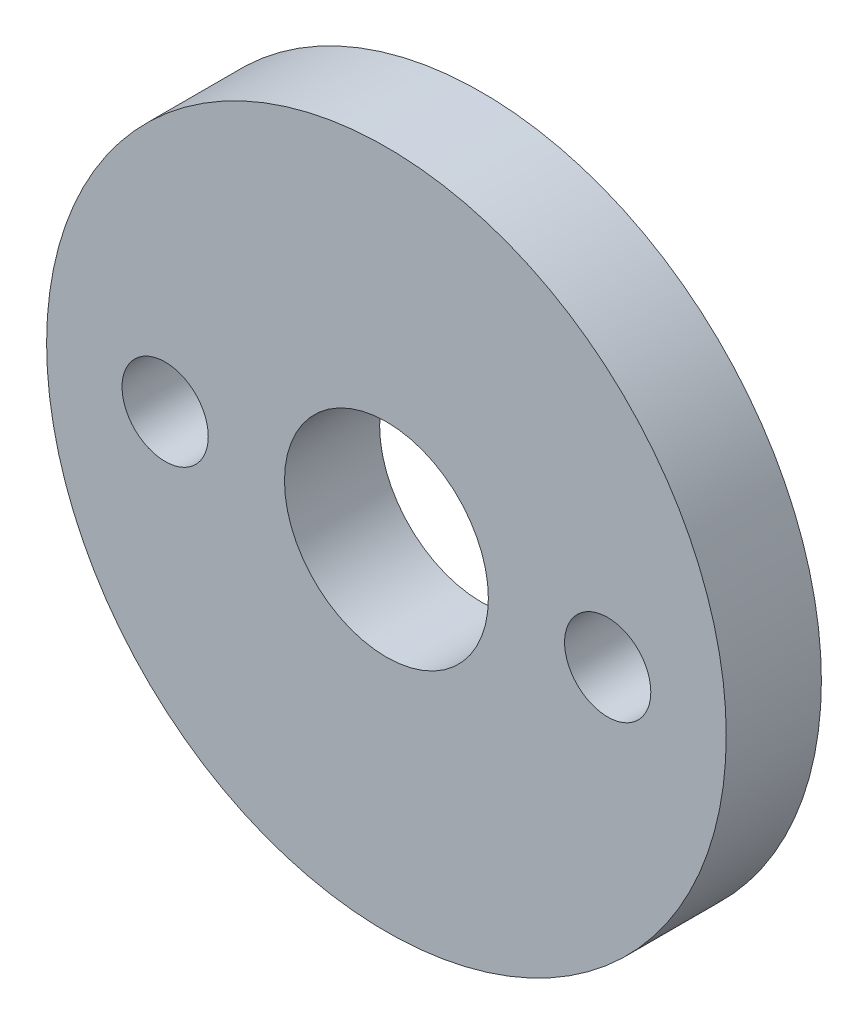
ISO-10303-21;
HEADER;
FILE_DESCRIPTION(('STEP AP214'),'2;1');
FILE_NAME('part.step','',(''),(''),'','','');
FILE_SCHEMA(('AUTOMOTIVE_DESIGN { 1 0 10303 214 1 1 1 1 }'));
ENDSEC;
DATA;
#1=APPLICATION_CONTEXT('core data for automotive mechanical design processes');
#2=APPLICATION_PROTOCOL_DEFINITION('international standard','automotive_design',2000,#1);
#3=PRODUCT_CONTEXT('',#1,'mechanical');
#4=PRODUCT('Part','Part','',(#3));
#5=PRODUCT_RELATED_PRODUCT_CATEGORY('part','',(#4));
#6=PRODUCT_DEFINITION_FORMATION('','',#4);
#7=PRODUCT_DEFINITION_CONTEXT('part definition',#1,'design');
#8=PRODUCT_DEFINITION('design','',#6,#7);
#9=PRODUCT_DEFINITION_SHAPE('','',#8);
#10=(LENGTH_UNIT() NAMED_UNIT(*) SI_UNIT(.MILLI.,.METRE.));
#11=(NAMED_UNIT(*) PLANE_ANGLE_UNIT() SI_UNIT($,.RADIAN.));
#12=(NAMED_UNIT(*) SI_UNIT($,.STERADIAN.) SOLID_ANGLE_UNIT());
#13=UNCERTAINTY_MEASURE_WITH_UNIT(LENGTH_MEASURE(1.E-05),#10,'distance_accuracy_value','');
#14=(GEOMETRIC_REPRESENTATION_CONTEXT(3) GLOBAL_UNCERTAINTY_ASSIGNED_CONTEXT((#13)) GLOBAL_UNIT_ASSIGNED_CONTEXT((#10,
#11,#12)) REPRESENTATION_CONTEXT('',''));
#15=CARTESIAN_POINT('',(0.,0.,0.));
#16=DIRECTION('',(0.,0.,1.));
#17=DIRECTION('',(1.,0.,0.));
#18=AXIS2_PLACEMENT_3D('',#15,#16,#17);
#19=CARTESIAN_POINT('',(0.,0.,3.2004));
#20=DIRECTION('',(0.,0.,1.));
#21=DIRECTION('',(1.,0.,0.));
#22=AXIS2_PLACEMENT_3D('',#19,#20,#21);
#23=PLANE('',#22);
#24=CARTESIAN_POINT('',(-7.4422000541545,0.,3.2004));
#25=DIRECTION('',(0.,0.,1.));
#26=DIRECTION('',(1.,0.,0.));
#27=AXIS2_PLACEMENT_3D('',#24,#25,#26);
#28=CIRCLE('',#27,1.45);
#29=CARTESIAN_POINT('',(-5.9922000541545,0.,3.2004));
#30=VERTEX_POINT('',#29);
#31=EDGE_CURVE('E53',#30,#30,#28,.T.);
#32=ORIENTED_EDGE('',*,*,#31,.F.);
#33=EDGE_LOOP('',(#32));
#34=FACE_BOUND('',#33,.T.);
#35=CARTESIAN_POINT('',(7.4422000541545,0.,3.2004));
#36=DIRECTION('',(0.,0.,1.));
#37=DIRECTION('',(1.,0.,0.));
#38=AXIS2_PLACEMENT_3D('',#35,#36,#37);
#39=CIRCLE('',#38,1.45);
#40=CARTESIAN_POINT('',(8.8922000541545,0.,3.2004));
#41=VERTEX_POINT('',#40);
#42=EDGE_CURVE('E54',#41,#41,#39,.T.);
#43=ORIENTED_EDGE('',*,*,#42,.F.);
#44=EDGE_LOOP('',(#43));
#45=FACE_BOUND('',#44,.T.);
#46=CARTESIAN_POINT('',(0.,0.,3.2004));
#47=DIRECTION('',(0.,0.,1.));
#48=DIRECTION('',(1.,0.,0.));
#49=AXIS2_PLACEMENT_3D('',#46,#47,#48);
#50=CIRCLE('',#49,11.43);
#51=CARTESIAN_POINT('',(11.43,0.,3.2004));
#52=VERTEX_POINT('',#51);
#53=EDGE_CURVE('E10',#52,#52,#50,.T.);
#54=ORIENTED_EDGE('',*,*,#53,.T.);
#55=EDGE_LOOP('',(#54));
#56=FACE_BOUND('',#55,.T.);
#57=CARTESIAN_POINT('',(0.,0.,3.2004));
#58=DIRECTION('',(0.,0.,1.));
#59=DIRECTION('',(1.,0.,0.));
#60=AXIS2_PLACEMENT_3D('',#57,#58,#59);
#61=CIRCLE('',#60,3.429);
#62=CARTESIAN_POINT('',(3.429,0.,3.2004));
#63=VERTEX_POINT('',#62);
#64=EDGE_CURVE('E42',#63,#63,#61,.T.);
#65=ORIENTED_EDGE('',*,*,#64,.F.);
#66=EDGE_LOOP('',(#65));
#67=FACE_BOUND('',#66,.T.);
#68=ADVANCED_FACE('F31',(#34,#45,#56,#67),#23,.T.);
#69=CARTESIAN_POINT('',(0.,0.,0.));
#70=DIRECTION('',(0.,0.,1.));
#71=DIRECTION('',(1.,0.,0.));
#72=AXIS2_PLACEMENT_3D('',#69,#70,#71);
#73=PLANE('',#72);
#74=CARTESIAN_POINT('',(-7.4422000541545,0.,0.));
#75=DIRECTION('',(0.,0.,1.));
#76=DIRECTION('',(1.,0.,0.));
#77=AXIS2_PLACEMENT_3D('',#74,#75,#76);
#78=CIRCLE('',#77,1.45);
#79=CARTESIAN_POINT('',(-5.9922000541545,0.,0.));
#80=VERTEX_POINT('',#79);
#81=EDGE_CURVE('E47',#80,#80,#78,.F.);
#82=ORIENTED_EDGE('',*,*,#81,.F.);
#83=EDGE_LOOP('',(#82));
#84=FACE_BOUND('',#83,.T.);
#85=CARTESIAN_POINT('',(7.4422000541545,0.,0.));
#86=DIRECTION('',(0.,0.,1.));
#87=DIRECTION('',(1.,0.,0.));
#88=AXIS2_PLACEMENT_3D('',#85,#86,#87);
#89=CIRCLE('',#88,1.45);
#90=CARTESIAN_POINT('',(8.8922000541545,0.,0.));
#91=VERTEX_POINT('',#90);
#92=EDGE_CURVE('E50',#91,#91,#89,.F.);
#93=ORIENTED_EDGE('',*,*,#92,.F.);
#94=EDGE_LOOP('',(#93));
#95=FACE_BOUND('',#94,.T.);
#96=CARTESIAN_POINT('',(0.,0.,0.));
#97=DIRECTION('',(0.,0.,1.));
#98=DIRECTION('',(1.,0.,0.));
#99=AXIS2_PLACEMENT_3D('',#96,#97,#98);
#100=CIRCLE('',#99,11.43);
#101=CARTESIAN_POINT('',(11.43,0.,0.));
#102=VERTEX_POINT('',#101);
#103=EDGE_CURVE('E35',#102,#102,#100,.T.);
#104=ORIENTED_EDGE('',*,*,#103,.F.);
#105=EDGE_LOOP('',(#104));
#106=FACE_BOUND('',#105,.T.);
#107=CARTESIAN_POINT('',(0.,0.,0.));
#108=DIRECTION('',(0.,0.,1.));
#109=DIRECTION('',(1.,0.,0.));
#110=AXIS2_PLACEMENT_3D('',#107,#108,#109);
#111=CIRCLE('',#110,3.429);
#112=CARTESIAN_POINT('',(3.429,0.,0.));
#113=VERTEX_POINT('',#112);
#114=EDGE_CURVE('E44',#113,#113,#111,.T.);
#115=ORIENTED_EDGE('',*,*,#114,.T.);
#116=EDGE_LOOP('',(#115));
#117=FACE_BOUND('',#116,.T.);
#118=ADVANCED_FACE('F66',(#84,#95,#106,#117),#73,.F.);
#119=CARTESIAN_POINT('',(0.,0.,3.2004));
#120=DIRECTION('',(0.,0.,-1.));
#121=DIRECTION('',(-1.,0.,0.));
#122=AXIS2_PLACEMENT_3D('',#119,#120,#121);
#123=CYLINDRICAL_SURFACE('',#122,11.43);
#124=ORIENTED_EDGE('',*,*,#53,.F.);
#125=EDGE_LOOP('',(#124));
#126=FACE_BOUND('',#125,.T.);
#127=ORIENTED_EDGE('',*,*,#103,.T.);
#128=EDGE_LOOP('',(#127));
#129=FACE_BOUND('',#128,.T.);
#130=ADVANCED_FACE('F33',(#126,#129),#123,.T.);
#131=CARTESIAN_POINT('',(0.,0.,3.2004));
#132=DIRECTION('',(0.,0.,-1.));
#133=DIRECTION('',(-1.,0.,0.));
#134=AXIS2_PLACEMENT_3D('',#131,#132,#133);
#135=CYLINDRICAL_SURFACE('',#134,3.429);
#136=ORIENTED_EDGE('',*,*,#64,.T.);
#137=EDGE_LOOP('',(#136));
#138=FACE_BOUND('',#137,.T.);
#139=ORIENTED_EDGE('',*,*,#114,.F.);
#140=EDGE_LOOP('',(#139));
#141=FACE_BOUND('',#140,.T.);
#142=ADVANCED_FACE('F72',(#138,#141),#135,.F.);
#143=CARTESIAN_POINT('',(7.4422000541545,0.,-4.10121933088198));
#144=DIRECTION('',(0.,0.,1.));
#145=DIRECTION('',(1.,0.,0.));
#146=AXIS2_PLACEMENT_3D('',#143,#144,#145);
#147=CYLINDRICAL_SURFACE('',#146,1.45);
#148=ORIENTED_EDGE('',*,*,#92,.T.);
#149=EDGE_LOOP('',(#148));
#150=FACE_BOUND('',#149,.T.);
#151=ORIENTED_EDGE('',*,*,#42,.T.);
#152=EDGE_LOOP('',(#151));
#153=FACE_BOUND('',#152,.T.);
#154=ADVANCED_FACE('F75',(#150,#153),#147,.F.);
#155=CARTESIAN_POINT('',(-7.4422000541545,0.,-4.10121933088198));
#156=DIRECTION('',(0.,0.,1.));
#157=DIRECTION('',(1.,0.,0.));
#158=AXIS2_PLACEMENT_3D('',#155,#156,#157);
#159=CYLINDRICAL_SURFACE('',#158,1.45);
#160=ORIENTED_EDGE('',*,*,#81,.T.);
#161=EDGE_LOOP('',(#160));
#162=FACE_BOUND('',#161,.T.);
#163=ORIENTED_EDGE('',*,*,#31,.T.);
#164=EDGE_LOOP('',(#163));
#165=FACE_BOUND('',#164,.T.);
#166=ADVANCED_FACE('F62',(#162,#165),#159,.F.);
#167=CLOSED_SHELL('',(#68,#118,#130,#142,#154,#166));
#168=MANIFOLD_SOLID_BREP('B2',#167);
#169=ADVANCED_BREP_SHAPE_REPRESENTATION('',(#18,#168),#14);
#170=SHAPE_DEFINITION_REPRESENTATION(#9,#169);
ENDSEC;
END-ISO-10303-21;
